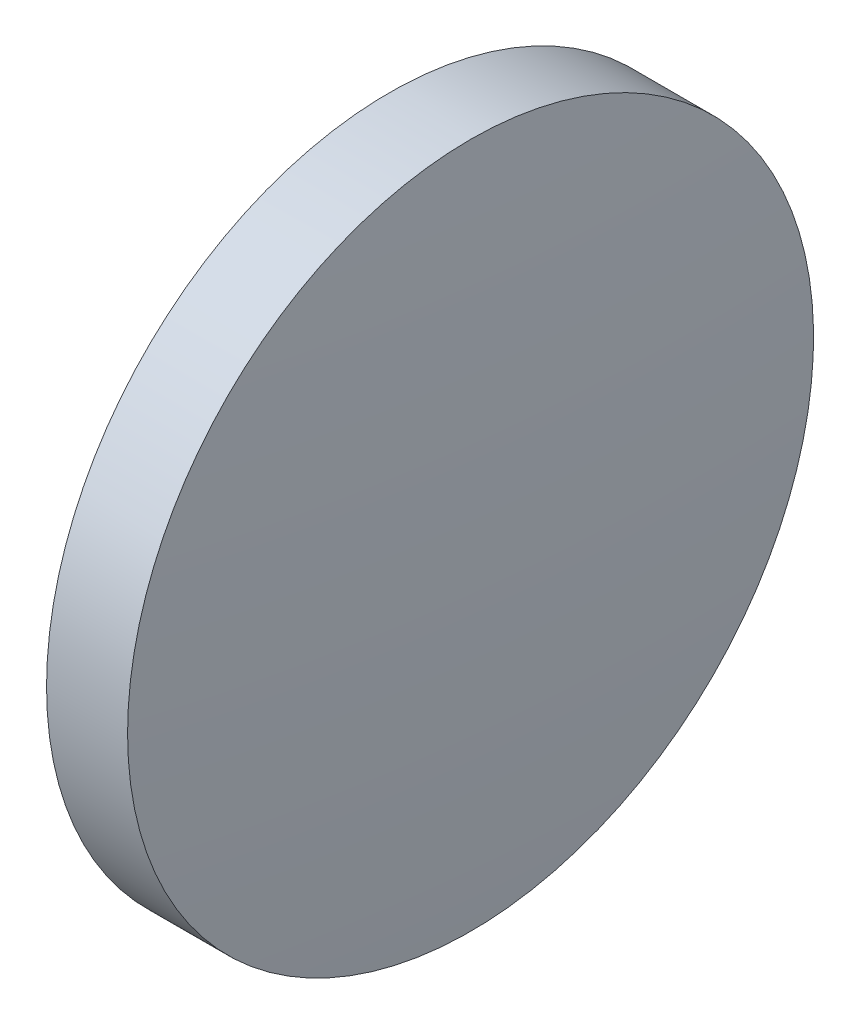
ISO-10303-21;
HEADER;
FILE_DESCRIPTION(('STEP AP214'),'2;1');
FILE_NAME('part.step','',(''),(''),'','','');
FILE_SCHEMA(('AUTOMOTIVE_DESIGN { 1 0 10303 214 1 1 1 1 }'));
ENDSEC;
DATA;
#1=APPLICATION_CONTEXT('core data for automotive mechanical design processes');
#2=APPLICATION_PROTOCOL_DEFINITION('international standard','automotive_design',2000,#1);
#3=PRODUCT_CONTEXT('',#1,'mechanical');
#4=PRODUCT('Part','Part','',(#3));
#5=PRODUCT_RELATED_PRODUCT_CATEGORY('part','',(#4));
#6=PRODUCT_DEFINITION_FORMATION('','',#4);
#7=PRODUCT_DEFINITION_CONTEXT('part definition',#1,'design');
#8=PRODUCT_DEFINITION('design','',#6,#7);
#9=PRODUCT_DEFINITION_SHAPE('','',#8);
#10=(LENGTH_UNIT() NAMED_UNIT(*) SI_UNIT(.MILLI.,.METRE.));
#11=(NAMED_UNIT(*) PLANE_ANGLE_UNIT() SI_UNIT($,.RADIAN.));
#12=(NAMED_UNIT(*) SI_UNIT($,.STERADIAN.) SOLID_ANGLE_UNIT());
#13=UNCERTAINTY_MEASURE_WITH_UNIT(LENGTH_MEASURE(1.E-05),#10,'distance_accuracy_value','');
#14=(GEOMETRIC_REPRESENTATION_CONTEXT(3) GLOBAL_UNCERTAINTY_ASSIGNED_CONTEXT((#13)) GLOBAL_UNIT_ASSIGNED_CONTEXT((#10,
#11,#12)) REPRESENTATION_CONTEXT('',''));
#15=CARTESIAN_POINT('',(0.,0.,0.));
#16=DIRECTION('',(0.,0.,1.));
#17=DIRECTION('',(1.,0.,0.));
#18=AXIS2_PLACEMENT_3D('',#15,#16,#17);
#19=CARTESIAN_POINT('',(-64.8183935691619,65.2335549264122,0.));
#20=DIRECTION('',(-1.,0.,0.));
#21=DIRECTION('',(0.,1.,0.));
#22=AXIS2_PLACEMENT_3D('',#19,#20,#21);
#23=SPHERICAL_SURFACE('',#22,184.031);
#24=CARTESIAN_POINT('',(118.773869233495,65.2335549264122,0.));
#25=DIRECTION('',(-1.,0.,0.));
#26=DIRECTION('',(0.,0.,1.));
#27=AXIS2_PLACEMENT_3D('',#24,#25,#26);
#28=CIRCLE('',#27,12.7);
#29=CARTESIAN_POINT('',(118.773869233495,65.2335549264122,12.7));
#30=VERTEX_POINT('',#29);
#31=EDGE_CURVE('E10',#30,#30,#28,.T.);
#32=ORIENTED_EDGE('',*,*,#31,.F.);
#33=EDGE_LOOP('',(#32));
#34=FACE_BOUND('',#33,.T.);
#35=ADVANCED_FACE('F35',(#34),#23,.T.);
#36=CARTESIAN_POINT('',(110.165373228488,65.2335549264122,0.));
#37=DIRECTION('',(-1.,0.,0.));
#38=DIRECTION('',(0.,0.,1.));
#39=AXIS2_PLACEMENT_3D('',#36,#37,#38);
#40=CYLINDRICAL_SURFACE('',#39,12.7);
#41=CARTESIAN_POINT('',(115.773606430838,65.2335549264122,0.));
#42=DIRECTION('',(-1.,0.,0.));
#43=DIRECTION('',(0.,0.,1.));
#44=AXIS2_PLACEMENT_3D('',#41,#42,#43);
#45=CIRCLE('',#44,12.7);
#46=CARTESIAN_POINT('',(115.773606430838,65.2335549264122,12.7));
#47=VERTEX_POINT('',#46);
#48=EDGE_CURVE('E41',#47,#47,#45,.T.);
#49=ORIENTED_EDGE('',*,*,#48,.F.);
#50=EDGE_LOOP('',(#49));
#51=FACE_BOUND('',#50,.T.);
#52=ORIENTED_EDGE('',*,*,#31,.T.);
#53=EDGE_LOOP('',(#52));
#54=FACE_BOUND('',#53,.T.);
#55=ADVANCED_FACE('F49',(#51,#54),#40,.T.);
#56=CARTESIAN_POINT('',(115.773606430838,65.2335549264122,0.));
#57=DIRECTION('',(1.,0.,0.));
#58=DIRECTION('',(0.,0.,-1.));
#59=AXIS2_PLACEMENT_3D('',#56,#57,#58);
#60=PLANE('',#59);
#61=ORIENTED_EDGE('',*,*,#48,.T.);
#62=EDGE_LOOP('',(#61));
#63=FACE_BOUND('',#62,.T.);
#64=ADVANCED_FACE('F47',(#63),#60,.F.);
#65=CLOSED_SHELL('',(#35,#55,#64));
#66=MANIFOLD_SOLID_BREP('B2',#65);
#67=ADVANCED_BREP_SHAPE_REPRESENTATION('',(#18,#66),#14);
#68=SHAPE_DEFINITION_REPRESENTATION(#9,#67);
ENDSEC;
END-ISO-10303-21;
